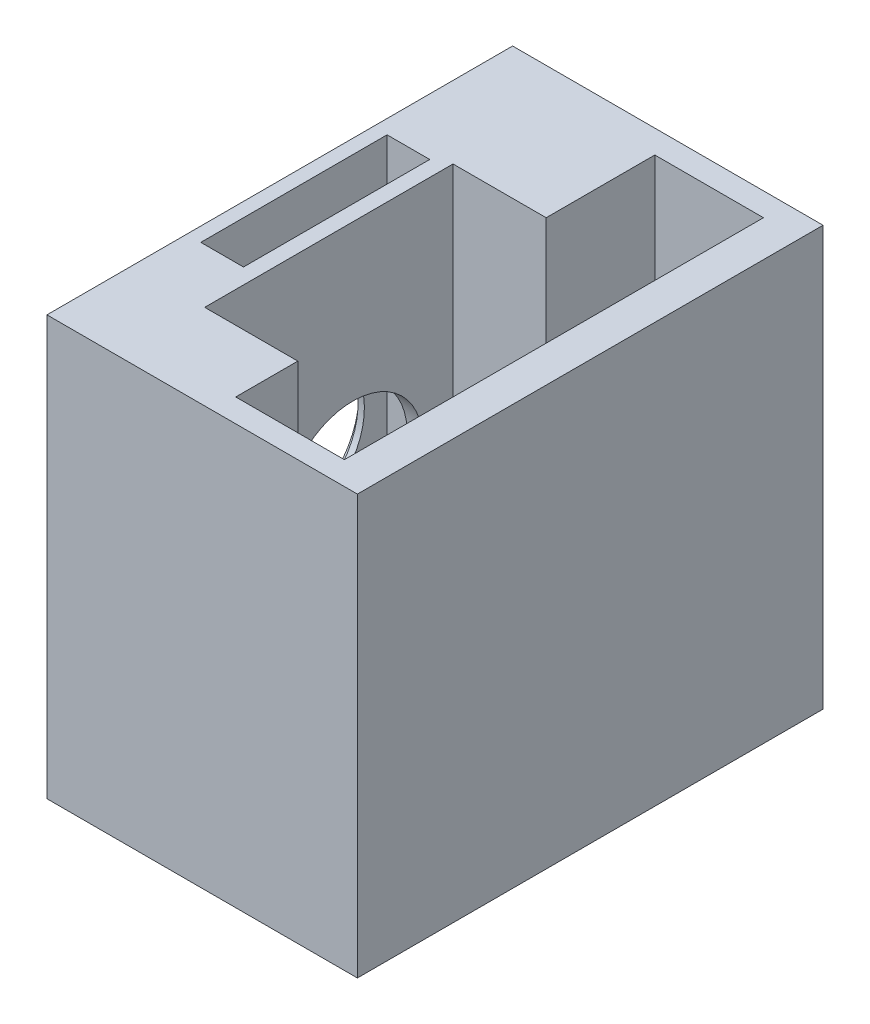
ISO-10303-21;
HEADER;
FILE_DESCRIPTION(('STEP AP214'),'2;1');
FILE_NAME('part.step','',(''),(''),'','','');
FILE_SCHEMA(('AUTOMOTIVE_DESIGN { 1 0 10303 214 1 1 1 1 }'));
ENDSEC;
DATA;
#1=APPLICATION_CONTEXT('core data for automotive mechanical design processes');
#2=APPLICATION_PROTOCOL_DEFINITION('international standard','automotive_design',2000,#1);
#3=PRODUCT_CONTEXT('',#1,'mechanical');
#4=PRODUCT('Part','Part','',(#3));
#5=PRODUCT_RELATED_PRODUCT_CATEGORY('part','',(#4));
#6=PRODUCT_DEFINITION_FORMATION('','',#4);
#7=PRODUCT_DEFINITION_CONTEXT('part definition',#1,'design');
#8=PRODUCT_DEFINITION('design','',#6,#7);
#9=PRODUCT_DEFINITION_SHAPE('','',#8);
#10=(LENGTH_UNIT() NAMED_UNIT(*) SI_UNIT(.MILLI.,.METRE.));
#11=(NAMED_UNIT(*) PLANE_ANGLE_UNIT() SI_UNIT($,.RADIAN.));
#12=(NAMED_UNIT(*) SI_UNIT($,.STERADIAN.) SOLID_ANGLE_UNIT());
#13=UNCERTAINTY_MEASURE_WITH_UNIT(LENGTH_MEASURE(1.E-05),#10,'distance_accuracy_value','');
#14=(GEOMETRIC_REPRESENTATION_CONTEXT(3) GLOBAL_UNCERTAINTY_ASSIGNED_CONTEXT((#13)) GLOBAL_UNIT_ASSIGNED_CONTEXT((#10,
#11,#12)) REPRESENTATION_CONTEXT('',''));
#15=CARTESIAN_POINT('',(0.,0.,0.));
#16=DIRECTION('',(0.,0.,1.));
#17=DIRECTION('',(1.,0.,0.));
#18=AXIS2_PLACEMENT_3D('',#15,#16,#17);
#19=CARTESIAN_POINT('',(0.,9.5,0.));
#20=DIRECTION('',(0.,1.,0.));
#21=DIRECTION('',(0.,0.,1.));
#22=AXIS2_PLACEMENT_3D('',#19,#20,#21);
#23=PLANE('',#22);
#24=DIRECTION('',(-1.,0.,0.));
#25=VECTOR('',#24,1.);
#26=CARTESIAN_POINT('',(5.5,9.5,-18.3941019662497));
#27=LINE('',#26,#25);
#28=CARTESIAN_POINT('',(3.66196126146727,9.5,-18.3941019662497));
#29=VERTEX_POINT('',#28);
#30=CARTESIAN_POINT('',(0.911961261467271,9.5,-18.3941019662497));
#31=VERTEX_POINT('',#30);
#32=EDGE_CURVE('E11',#29,#31,#27,.T.);
#33=ORIENTED_EDGE('',*,*,#32,.F.);
#34=DIRECTION('',(0.,0.,-1.));
#35=VECTOR('',#34,1.);
#36=CARTESIAN_POINT('',(3.66196126146727,9.5,-21.));
#37=LINE('',#36,#35);
#38=CARTESIAN_POINT('',(3.66196126146727,9.5,-21.));
#39=VERTEX_POINT('',#38);
#40=EDGE_CURVE('E172',#29,#39,#37,.T.);
#41=ORIENTED_EDGE('',*,*,#40,.T.);
#42=DIRECTION('',(-1.,0.,0.));
#43=VECTOR('',#42,1.);
#44=CARTESIAN_POINT('',(0.911961261467271,9.5,-21.));
#45=LINE('',#44,#43);
#46=CARTESIAN_POINT('',(0.911961261467271,9.5,-21.));
#47=VERTEX_POINT('',#46);
#48=EDGE_CURVE('E178',#39,#47,#45,.T.);
#49=ORIENTED_EDGE('',*,*,#48,.T.);
#50=DIRECTION('',(0.,0.,1.));
#51=VECTOR('',#50,1.);
#52=CARTESIAN_POINT('',(0.911961261467271,9.5,-21.));
#53=LINE('',#52,#51);
#54=EDGE_CURVE('E588',#47,#31,#53,.T.);
#55=ORIENTED_EDGE('',*,*,#54,.T.);
#56=EDGE_LOOP('',(#33,#41,#49,#55));
#57=FACE_BOUND('',#56,.T.);
#58=ADVANCED_FACE('F34',(#57),#23,.T.);
#59=CARTESIAN_POINT('',(20.,27.,0.));
#60=DIRECTION('',(0.,-1.,0.));
#61=DIRECTION('',(0.,0.,-1.));
#62=AXIS2_PLACEMENT_3D('',#59,#60,#61);
#63=PLANE('',#62);
#64=DIRECTION('',(1.,0.,0.));
#65=VECTOR('',#64,1.);
#66=CARTESIAN_POINT('',(0.911961261467272,27.,-9.));
#67=LINE('',#66,#65);
#68=CARTESIAN_POINT('',(0.911961261467274,27.,-9.));
#69=VERTEX_POINT('',#68);
#70=CARTESIAN_POINT('',(3.66196126146727,27.,-9.));
#71=VERTEX_POINT('',#70);
#72=EDGE_CURVE('E187',#69,#71,#67,.T.);
#73=ORIENTED_EDGE('',*,*,#72,.F.);
#74=DIRECTION('',(0.,0.,1.));
#75=VECTOR('',#74,1.);
#76=CARTESIAN_POINT('',(0.911961261467271,27.,-21.));
#77=LINE('',#76,#75);
#78=CARTESIAN_POINT('',(0.911961261467271,27.,-21.));
#79=VERTEX_POINT('',#78);
#80=EDGE_CURVE('E56',#79,#69,#77,.T.);
#81=ORIENTED_EDGE('',*,*,#80,.F.);
#82=DIRECTION('',(-1.,0.,0.));
#83=VECTOR('',#82,1.);
#84=CARTESIAN_POINT('',(0.911961261467271,27.,-21.));
#85=LINE('',#84,#83);
#86=CARTESIAN_POINT('',(3.66196126146727,27.,-21.));
#87=VERTEX_POINT('',#86);
#88=EDGE_CURVE('E194',#87,#79,#85,.T.);
#89=ORIENTED_EDGE('',*,*,#88,.F.);
#90=DIRECTION('',(0.,0.,-1.));
#91=VECTOR('',#90,1.);
#92=CARTESIAN_POINT('',(3.66196126146727,27.,-21.));
#93=LINE('',#92,#91);
#94=EDGE_CURVE('E191',#71,#87,#93,.T.);
#95=ORIENTED_EDGE('',*,*,#94,.F.);
#96=EDGE_LOOP('',(#73,#81,#89,#95));
#97=FACE_BOUND('',#96,.T.);
#98=DIRECTION('',(0.,0.,1.));
#99=VECTOR('',#98,1.);
#100=CARTESIAN_POINT('',(0.,27.,0.));
#101=LINE('',#100,#99);
#102=CARTESIAN_POINT('',(0.,27.,-30.));
#103=VERTEX_POINT('',#102);
#104=CARTESIAN_POINT('',(0.,27.,0.));
#105=VERTEX_POINT('',#104);
#106=EDGE_CURVE('E278',#103,#105,#101,.T.);
#107=ORIENTED_EDGE('',*,*,#106,.T.);
#108=DIRECTION('',(-1.,0.,0.));
#109=VECTOR('',#108,1.);
#110=CARTESIAN_POINT('',(20.,27.,0.));
#111=LINE('',#110,#109);
#112=CARTESIAN_POINT('',(20.,27.,0.));
#113=VERTEX_POINT('',#112);
#114=EDGE_CURVE('E284',#113,#105,#111,.T.);
#115=ORIENTED_EDGE('',*,*,#114,.F.);
#116=DIRECTION('',(0.,0.,1.));
#117=VECTOR('',#116,1.);
#118=CARTESIAN_POINT('',(20.,27.,0.));
#119=LINE('',#118,#117);
#120=CARTESIAN_POINT('',(20.,27.,-30.));
#121=VERTEX_POINT('',#120);
#122=EDGE_CURVE('E282',#121,#113,#119,.T.);
#123=ORIENTED_EDGE('',*,*,#122,.F.);
#124=DIRECTION('',(-1.,0.,0.));
#125=VECTOR('',#124,1.);
#126=CARTESIAN_POINT('',(20.,27.,-30.));
#127=LINE('',#126,#125);
#128=EDGE_CURVE('E294',#121,#103,#127,.T.);
#129=ORIENTED_EDGE('',*,*,#128,.T.);
#130=EDGE_LOOP('',(#107,#115,#123,#129));
#131=FACE_BOUND('',#130,.T.);
#132=DIRECTION('',(0.,0.,1.));
#133=VECTOR('',#132,1.);
#134=CARTESIAN_POINT('',(4.66196126146727,27.,-21.5));
#135=LINE('',#134,#133);
#136=CARTESIAN_POINT('',(4.66196126146727,27.,-21.5));
#137=VERTEX_POINT('',#136);
#138=CARTESIAN_POINT('',(4.66196126146727,27.,-5.5));
#139=VERTEX_POINT('',#138);
#140=EDGE_CURVE('E209',#137,#139,#135,.T.);
#141=ORIENTED_EDGE('',*,*,#140,.F.);
#142=DIRECTION('',(-1.,0.,0.));
#143=VECTOR('',#142,1.);
#144=CARTESIAN_POINT('',(4.66196126146727,27.,-21.5));
#145=LINE('',#144,#143);
#146=CARTESIAN_POINT('',(10.6619612614673,27.,-21.5));
#147=VERTEX_POINT('',#146);
#148=EDGE_CURVE('E216',#147,#137,#145,.T.);
#149=ORIENTED_EDGE('',*,*,#148,.F.);
#150=DIRECTION('',(0.,0.,1.));
#151=VECTOR('',#150,1.);
#152=CARTESIAN_POINT('',(10.6619612614673,26.9999999999758,-28.5));
#153=LINE('',#152,#151);
#154=CARTESIAN_POINT('',(10.6619612614673,27.,-28.5));
#155=VERTEX_POINT('',#154);
#156=EDGE_CURVE('E243',#155,#147,#153,.T.);
#157=ORIENTED_EDGE('',*,*,#156,.F.);
#158=DIRECTION('',(1.,0.,0.));
#159=VECTOR('',#158,1.);
#160=CARTESIAN_POINT('',(10.6619612614673,26.9999999999758,-28.5));
#161=LINE('',#160,#159);
#162=CARTESIAN_POINT('',(17.6619612614673,26.9999999999758,-28.5));
#163=VERTEX_POINT('',#162);
#164=EDGE_CURVE('E232',#155,#163,#161,.T.);
#165=ORIENTED_EDGE('',*,*,#164,.T.);
#166=DIRECTION('',(0.,0.,1.));
#167=VECTOR('',#166,1.);
#168=CARTESIAN_POINT('',(17.6619612614673,26.9999999999758,-28.5));
#169=LINE('',#168,#167);
#170=CARTESIAN_POINT('',(17.6619612614673,26.9999999999758,-1.5));
#171=VERTEX_POINT('',#170);
#172=EDGE_CURVE('E254',#163,#171,#169,.T.);
#173=ORIENTED_EDGE('',*,*,#172,.T.);
#174=DIRECTION('',(1.,0.,0.));
#175=VECTOR('',#174,1.);
#176=CARTESIAN_POINT('',(10.6619612614673,26.9999999999758,-1.5));
#177=LINE('',#176,#175);
#178=CARTESIAN_POINT('',(10.6619612614673,26.9999999999758,-1.5));
#179=VERTEX_POINT('',#178);
#180=EDGE_CURVE('E257',#179,#171,#177,.T.);
#181=ORIENTED_EDGE('',*,*,#180,.F.);
#182=CARTESIAN_POINT('',(10.6619612614673,27.,-5.5));
#183=VERTEX_POINT('',#182);
#184=EDGE_CURVE('E260',#183,#179,#153,.T.);
#185=ORIENTED_EDGE('',*,*,#184,.F.);
#186=DIRECTION('',(1.,0.,0.));
#187=VECTOR('',#186,1.);
#188=CARTESIAN_POINT('',(4.66196126146727,27.,-5.5));
#189=LINE('',#188,#187);
#190=EDGE_CURVE('E226',#139,#183,#189,.T.);
#191=ORIENTED_EDGE('',*,*,#190,.F.);
#192=EDGE_LOOP('',(#141,#149,#157,#165,#173,#181,#185,#191));
#193=FACE_BOUND('',#192,.T.);
#194=ADVANCED_FACE('F319',(#97,#131,#193),#63,.F.);
#195=CARTESIAN_POINT('',(20.,0.,0.));
#196=DIRECTION('',(0.,0.,-1.));
#197=DIRECTION('',(0.,1.,0.));
#198=AXIS2_PLACEMENT_3D('',#195,#196,#197);
#199=PLANE('',#198);
#200=DIRECTION('',(0.,-1.,0.));
#201=VECTOR('',#200,1.);
#202=CARTESIAN_POINT('',(0.,0.,0.));
#203=LINE('',#202,#201);
#204=CARTESIAN_POINT('',(0.,0.,0.));
#205=VERTEX_POINT('',#204);
#206=EDGE_CURVE('E273',#105,#205,#203,.T.);
#207=ORIENTED_EDGE('',*,*,#206,.T.);
#208=DIRECTION('',(-1.,0.,0.));
#209=VECTOR('',#208,1.);
#210=CARTESIAN_POINT('',(20.,0.,0.));
#211=LINE('',#210,#209);
#212=CARTESIAN_POINT('',(20.,0.,0.));
#213=VERTEX_POINT('',#212);
#214=EDGE_CURVE('E164',#213,#205,#211,.T.);
#215=ORIENTED_EDGE('',*,*,#214,.F.);
#216=DIRECTION('',(0.,-1.,0.));
#217=VECTOR('',#216,1.);
#218=CARTESIAN_POINT('',(20.,0.,0.));
#219=LINE('',#218,#217);
#220=EDGE_CURVE('E274',#113,#213,#219,.T.);
#221=ORIENTED_EDGE('',*,*,#220,.F.);
#222=ORIENTED_EDGE('',*,*,#114,.T.);
#223=EDGE_LOOP('',(#207,#215,#221,#222));
#224=FACE_BOUND('',#223,.T.);
#225=ADVANCED_FACE('F36',(#224),#199,.F.);
#226=CARTESIAN_POINT('',(20.,0.,0.));
#227=DIRECTION('',(0.,1.,0.));
#228=DIRECTION('',(0.,0.,1.));
#229=AXIS2_PLACEMENT_3D('',#226,#227,#228);
#230=PLANE('',#229);
#231=DIRECTION('',(0.,0.,-1.));
#232=VECTOR('',#231,1.);
#233=CARTESIAN_POINT('',(0.,0.,0.));
#234=LINE('',#233,#232);
#235=CARTESIAN_POINT('',(0.,0.,-30.));
#236=VERTEX_POINT('',#235);
#237=EDGE_CURVE('E287',#205,#236,#234,.T.);
#238=ORIENTED_EDGE('',*,*,#237,.T.);
#239=DIRECTION('',(-1.,0.,0.));
#240=VECTOR('',#239,1.);
#241=CARTESIAN_POINT('',(20.,0.,-30.));
#242=LINE('',#241,#240);
#243=CARTESIAN_POINT('',(20.,0.,-30.));
#244=VERTEX_POINT('',#243);
#245=EDGE_CURVE('E297',#244,#236,#242,.T.);
#246=ORIENTED_EDGE('',*,*,#245,.F.);
#247=DIRECTION('',(0.,0.,-1.));
#248=VECTOR('',#247,1.);
#249=CARTESIAN_POINT('',(20.,0.,0.));
#250=LINE('',#249,#248);
#251=EDGE_CURVE('E277',#213,#244,#250,.T.);
#252=ORIENTED_EDGE('',*,*,#251,.F.);
#253=ORIENTED_EDGE('',*,*,#214,.T.);
#254=EDGE_LOOP('',(#238,#246,#252,#253));
#255=FACE_BOUND('',#254,.T.);
#256=ADVANCED_FACE('F303',(#255),#230,.F.);
#257=CARTESIAN_POINT('',(20.,0.,-30.));
#258=DIRECTION('',(0.,0.,1.));
#259=DIRECTION('',(1.,0.,0.));
#260=AXIS2_PLACEMENT_3D('',#257,#258,#259);
#261=PLANE('',#260);
#262=DIRECTION('',(0.,1.,0.));
#263=VECTOR('',#262,1.);
#264=CARTESIAN_POINT('',(0.,0.,-30.));
#265=LINE('',#264,#263);
#266=EDGE_CURVE('E289',#236,#103,#265,.T.);
#267=ORIENTED_EDGE('',*,*,#266,.T.);
#268=ORIENTED_EDGE('',*,*,#128,.F.);
#269=DIRECTION('',(0.,1.,0.));
#270=VECTOR('',#269,1.);
#271=CARTESIAN_POINT('',(20.,0.,-30.));
#272=LINE('',#271,#270);
#273=EDGE_CURVE('E280',#244,#121,#272,.T.);
#274=ORIENTED_EDGE('',*,*,#273,.F.);
#275=ORIENTED_EDGE('',*,*,#245,.T.);
#276=EDGE_LOOP('',(#267,#268,#274,#275));
#277=FACE_BOUND('',#276,.T.);
#278=ADVANCED_FACE('F315',(#277),#261,.F.);
#279=CARTESIAN_POINT('',(20.,0.,0.));
#280=DIRECTION('',(-1.,0.,0.));
#281=DIRECTION('',(0.,0.,1.));
#282=AXIS2_PLACEMENT_3D('',#279,#280,#281);
#283=PLANE('',#282);
#284=ORIENTED_EDGE('',*,*,#220,.T.);
#285=ORIENTED_EDGE('',*,*,#251,.T.);
#286=ORIENTED_EDGE('',*,*,#273,.T.);
#287=ORIENTED_EDGE('',*,*,#122,.T.);
#288=EDGE_LOOP('',(#284,#285,#286,#287));
#289=FACE_BOUND('',#288,.T.);
#290=ADVANCED_FACE('F322',(#289),#283,.F.);
#291=CARTESIAN_POINT('',(0.,0.,0.));
#292=DIRECTION('',(-1.,0.,0.));
#293=DIRECTION('',(0.,0.,1.));
#294=AXIS2_PLACEMENT_3D('',#291,#292,#293);
#295=PLANE('',#294);
#296=CARTESIAN_POINT('',(0.,12.5,-15.1));
#297=DIRECTION('',(-1.,0.,0.));
#298=DIRECTION('',(0.,0.,1.));
#299=AXIS2_PLACEMENT_3D('',#296,#297,#298);
#300=CIRCLE('',#299,5.);
#301=CARTESIAN_POINT('',(0.,12.5,-10.1));
#302=VERTEX_POINT('',#301);
#303=EDGE_CURVE('E200',#302,#302,#300,.T.);
#304=ORIENTED_EDGE('',*,*,#303,.F.);
#305=EDGE_LOOP('',(#304));
#306=FACE_BOUND('',#305,.T.);
#307=ORIENTED_EDGE('',*,*,#206,.F.);
#308=ORIENTED_EDGE('',*,*,#106,.F.);
#309=ORIENTED_EDGE('',*,*,#266,.F.);
#310=ORIENTED_EDGE('',*,*,#237,.F.);
#311=EDGE_LOOP('',(#307,#308,#309,#310));
#312=FACE_BOUND('',#311,.T.);
#313=ADVANCED_FACE('F311',(#306,#312),#295,.T.);
#314=CARTESIAN_POINT('',(10.6619612614673,0.999999999975808,-28.5));
#315=DIRECTION('',(0.,0.,1.));
#316=DIRECTION('',(1.,0.,0.));
#317=AXIS2_PLACEMENT_3D('',#314,#315,#316);
#318=PLANE('',#317);
#319=ORIENTED_EDGE('',*,*,#164,.F.);
#320=DIRECTION('',(0.,1.,0.));
#321=VECTOR('',#320,1.);
#322=CARTESIAN_POINT('',(10.6619612614673,0.999999999975808,-28.5));
#323=LINE('',#322,#321);
#324=CARTESIAN_POINT('',(10.6619612614673,0.999999999975808,-28.5));
#325=VERTEX_POINT('',#324);
#326=EDGE_CURVE('E251',#325,#155,#323,.T.);
#327=ORIENTED_EDGE('',*,*,#326,.F.);
#328=DIRECTION('',(1.,0.,0.));
#329=VECTOR('',#328,1.);
#330=CARTESIAN_POINT('',(10.6619612614673,0.999999999975808,-28.5));
#331=LINE('',#330,#329);
#332=CARTESIAN_POINT('',(17.6619612614673,0.999999999975808,-28.5));
#333=VERTEX_POINT('',#332);
#334=EDGE_CURVE('E239',#325,#333,#331,.T.);
#335=ORIENTED_EDGE('',*,*,#334,.T.);
#336=DIRECTION('',(0.,1.,0.));
#337=VECTOR('',#336,1.);
#338=CARTESIAN_POINT('',(17.6619612614673,0.999999999975808,-28.5));
#339=LINE('',#338,#337);
#340=EDGE_CURVE('E270',#333,#163,#339,.T.);
#341=ORIENTED_EDGE('',*,*,#340,.T.);
#342=EDGE_LOOP('',(#319,#327,#335,#341));
#343=FACE_BOUND('',#342,.T.);
#344=ADVANCED_FACE('F329',(#343),#318,.T.);
#345=CARTESIAN_POINT('',(17.6619612614673,0.999999999975808,-28.5));
#346=DIRECTION('',(-1.,0.,0.));
#347=DIRECTION('',(0.,0.,1.));
#348=AXIS2_PLACEMENT_3D('',#345,#346,#347);
#349=PLANE('',#348);
#350=ORIENTED_EDGE('',*,*,#172,.F.);
#351=ORIENTED_EDGE('',*,*,#340,.F.);
#352=DIRECTION('',(0.,0.,1.));
#353=VECTOR('',#352,1.);
#354=CARTESIAN_POINT('',(17.6619612614673,0.999999999975808,-28.5));
#355=LINE('',#354,#353);
#356=CARTESIAN_POINT('',(17.6619612614673,0.999999999975808,-1.5));
#357=VERTEX_POINT('',#356);
#358=EDGE_CURVE('E242',#333,#357,#355,.T.);
#359=ORIENTED_EDGE('',*,*,#358,.T.);
#360=DIRECTION('',(0.,1.,0.));
#361=VECTOR('',#360,1.);
#362=CARTESIAN_POINT('',(17.6619612614673,0.999999999975808,-1.5));
#363=LINE('',#362,#361);
#364=EDGE_CURVE('E268',#357,#171,#363,.T.);
#365=ORIENTED_EDGE('',*,*,#364,.T.);
#366=EDGE_LOOP('',(#350,#351,#359,#365));
#367=FACE_BOUND('',#366,.T.);
#368=ADVANCED_FACE('F397',(#367),#349,.T.);
#369=CARTESIAN_POINT('',(10.6619612614673,0.999999999975808,-1.5));
#370=DIRECTION('',(0.,0.,1.));
#371=DIRECTION('',(1.,0.,0.));
#372=AXIS2_PLACEMENT_3D('',#369,#370,#371);
#373=PLANE('',#372);
#374=ORIENTED_EDGE('',*,*,#180,.T.);
#375=ORIENTED_EDGE('',*,*,#364,.F.);
#376=DIRECTION('',(1.,0.,0.));
#377=VECTOR('',#376,1.);
#378=CARTESIAN_POINT('',(10.6619612614673,0.999999999975808,-1.5));
#379=LINE('',#378,#377);
#380=CARTESIAN_POINT('',(10.6619612614673,0.999999999975808,-1.5));
#381=VERTEX_POINT('',#380);
#382=EDGE_CURVE('E245',#381,#357,#379,.T.);
#383=ORIENTED_EDGE('',*,*,#382,.F.);
#384=DIRECTION('',(0.,1.,0.));
#385=VECTOR('',#384,1.);
#386=CARTESIAN_POINT('',(10.6619612614673,0.999999999975808,-1.5));
#387=LINE('',#386,#385);
#388=EDGE_CURVE('E265',#381,#179,#387,.T.);
#389=ORIENTED_EDGE('',*,*,#388,.T.);
#390=EDGE_LOOP('',(#374,#375,#383,#389));
#391=FACE_BOUND('',#390,.T.);
#392=ADVANCED_FACE('F393',(#391),#373,.F.);
#393=CARTESIAN_POINT('',(10.6619612614673,0.999999999975808,-28.5));
#394=DIRECTION('',(-1.,0.,0.));
#395=DIRECTION('',(0.,0.,1.));
#396=AXIS2_PLACEMENT_3D('',#393,#394,#395);
#397=PLANE('',#396);
#398=ORIENTED_EDGE('',*,*,#156,.T.);
#399=DIRECTION('',(0.,1.,0.));
#400=VECTOR('',#399,1.);
#401=CARTESIAN_POINT('',(10.6619612614673,6.,-21.5));
#402=LINE('',#401,#400);
#403=CARTESIAN_POINT('',(10.6619612614673,6.,-21.5));
#404=VERTEX_POINT('',#403);
#405=EDGE_CURVE('E233',#404,#147,#402,.T.);
#406=ORIENTED_EDGE('',*,*,#405,.F.);
#407=DIRECTION('',(0.,0.,-1.));
#408=VECTOR('',#407,1.);
#409=CARTESIAN_POINT('',(10.6619612614673,6.,-21.5));
#410=LINE('',#409,#408);
#411=CARTESIAN_POINT('',(10.6619612614673,6.,-5.5));
#412=VERTEX_POINT('',#411);
#413=EDGE_CURVE('E218',#412,#404,#410,.T.);
#414=ORIENTED_EDGE('',*,*,#413,.F.);
#415=DIRECTION('',(0.,1.,0.));
#416=VECTOR('',#415,1.);
#417=CARTESIAN_POINT('',(10.6619612614673,6.,-5.5));
#418=LINE('',#417,#416);
#419=EDGE_CURVE('E235',#412,#183,#418,.T.);
#420=ORIENTED_EDGE('',*,*,#419,.T.);
#421=ORIENTED_EDGE('',*,*,#184,.T.);
#422=ORIENTED_EDGE('',*,*,#388,.F.);
#423=DIRECTION('',(0.,0.,1.));
#424=VECTOR('',#423,1.);
#425=CARTESIAN_POINT('',(10.6619612614673,0.999999999975808,-28.5));
#426=LINE('',#425,#424);
#427=EDGE_CURVE('E248',#325,#381,#426,.T.);
#428=ORIENTED_EDGE('',*,*,#427,.F.);
#429=ORIENTED_EDGE('',*,*,#326,.T.);
#430=EDGE_LOOP('',(#398,#406,#414,#420,#421,#422,#428,#429));
#431=FACE_BOUND('',#430,.T.);
#432=ADVANCED_FACE('F389',(#431),#397,.F.);
#433=CARTESIAN_POINT('',(0.,0.999999999975808,0.));
#434=DIRECTION('',(0.,-1.,0.));
#435=DIRECTION('',(0.,0.,-1.));
#436=AXIS2_PLACEMENT_3D('',#433,#434,#435);
#437=PLANE('',#436);
#438=ORIENTED_EDGE('',*,*,#334,.F.);
#439=ORIENTED_EDGE('',*,*,#427,.T.);
#440=ORIENTED_EDGE('',*,*,#382,.T.);
#441=ORIENTED_EDGE('',*,*,#358,.F.);
#442=EDGE_LOOP('',(#438,#439,#440,#441));
#443=FACE_BOUND('',#442,.T.);
#444=ADVANCED_FACE('F385',(#443),#437,.F.);
#445=CARTESIAN_POINT('',(4.66196126146727,6.,-21.5));
#446=DIRECTION('',(-1.,0.,0.));
#447=DIRECTION('',(0.,0.,1.));
#448=AXIS2_PLACEMENT_3D('',#445,#446,#447);
#449=PLANE('',#448);
#450=CARTESIAN_POINT('',(4.66196126146727,12.5,-15.04));
#451=DIRECTION('',(-1.,0.,0.));
#452=DIRECTION('',(0.,0.,1.));
#453=AXIS2_PLACEMENT_3D('',#450,#451,#452);
#454=CIRCLE('',#453,4.5);
#455=CARTESIAN_POINT('',(4.66196126146727,12.5,-10.54));
#456=VERTEX_POINT('',#455);
#457=EDGE_CURVE('E188',#456,#456,#454,.T.);
#458=ORIENTED_EDGE('',*,*,#457,.T.);
#459=EDGE_LOOP('',(#458));
#460=FACE_BOUND('',#459,.T.);
#461=ORIENTED_EDGE('',*,*,#140,.T.);
#462=DIRECTION('',(0.,1.,0.));
#463=VECTOR('',#462,1.);
#464=CARTESIAN_POINT('',(4.66196126146727,6.,-5.5));
#465=LINE('',#464,#463);
#466=CARTESIAN_POINT('',(4.66196126146727,6.,-5.5));
#467=VERTEX_POINT('',#466);
#468=EDGE_CURVE('E223',#467,#139,#465,.T.);
#469=ORIENTED_EDGE('',*,*,#468,.F.);
#470=DIRECTION('',(0.,0.,1.));
#471=VECTOR('',#470,1.);
#472=CARTESIAN_POINT('',(4.66196126146727,6.,-21.5));
#473=LINE('',#472,#471);
#474=CARTESIAN_POINT('',(4.66196126146727,6.,-21.5));
#475=VERTEX_POINT('',#474);
#476=EDGE_CURVE('E212',#475,#467,#473,.T.);
#477=ORIENTED_EDGE('',*,*,#476,.F.);
#478=DIRECTION('',(0.,1.,0.));
#479=VECTOR('',#478,1.);
#480=CARTESIAN_POINT('',(4.66196126146727,6.,-21.5));
#481=LINE('',#480,#479);
#482=EDGE_CURVE('E230',#475,#137,#481,.T.);
#483=ORIENTED_EDGE('',*,*,#482,.T.);
#484=EDGE_LOOP('',(#461,#469,#477,#483));
#485=FACE_BOUND('',#484,.T.);
#486=ADVANCED_FACE('F378',(#460,#485),#449,.F.);
#487=CARTESIAN_POINT('',(4.66196126146727,6.,-21.5));
#488=DIRECTION('',(0.,0.,-1.));
#489=DIRECTION('',(-1.,0.,0.));
#490=AXIS2_PLACEMENT_3D('',#487,#488,#489);
#491=PLANE('',#490);
#492=ORIENTED_EDGE('',*,*,#148,.T.);
#493=ORIENTED_EDGE('',*,*,#482,.F.);
#494=DIRECTION('',(-1.,0.,0.));
#495=VECTOR('',#494,1.);
#496=CARTESIAN_POINT('',(4.66196126146727,6.,-21.5));
#497=LINE('',#496,#495);
#498=EDGE_CURVE('E220',#404,#475,#497,.T.);
#499=ORIENTED_EDGE('',*,*,#498,.F.);
#500=ORIENTED_EDGE('',*,*,#405,.T.);
#501=EDGE_LOOP('',(#492,#493,#499,#500));
#502=FACE_BOUND('',#501,.T.);
#503=ADVANCED_FACE('F375',(#502),#491,.F.);
#504=CARTESIAN_POINT('',(4.66196126146727,6.,-5.5));
#505=DIRECTION('',(0.,0.,1.));
#506=DIRECTION('',(1.,0.,0.));
#507=AXIS2_PLACEMENT_3D('',#504,#505,#506);
#508=PLANE('',#507);
#509=ORIENTED_EDGE('',*,*,#190,.T.);
#510=ORIENTED_EDGE('',*,*,#419,.F.);
#511=DIRECTION('',(1.,0.,0.));
#512=VECTOR('',#511,1.);
#513=CARTESIAN_POINT('',(4.66196126146727,6.,-5.5));
#514=LINE('',#513,#512);
#515=EDGE_CURVE('E215',#467,#412,#514,.T.);
#516=ORIENTED_EDGE('',*,*,#515,.F.);
#517=ORIENTED_EDGE('',*,*,#468,.T.);
#518=EDGE_LOOP('',(#509,#510,#516,#517));
#519=FACE_BOUND('',#518,.T.);
#520=ADVANCED_FACE('F373',(#519),#508,.F.);
#521=CARTESIAN_POINT('',(0.,6.,0.));
#522=DIRECTION('',(0.,1.,0.));
#523=DIRECTION('',(0.,0.,1.));
#524=AXIS2_PLACEMENT_3D('',#521,#522,#523);
#525=PLANE('',#524);
#526=ORIENTED_EDGE('',*,*,#476,.T.);
#527=ORIENTED_EDGE('',*,*,#515,.T.);
#528=ORIENTED_EDGE('',*,*,#413,.T.);
#529=ORIENTED_EDGE('',*,*,#498,.T.);
#530=EDGE_LOOP('',(#526,#527,#528,#529));
#531=FACE_BOUND('',#530,.T.);
#532=ADVANCED_FACE('F369',(#531),#525,.T.);
#533=CARTESIAN_POINT('',(0.5,12.5,-15.1));
#534=DIRECTION('',(-1.,0.,0.));
#535=DIRECTION('',(0.,0.,1.));
#536=AXIS2_PLACEMENT_3D('',#533,#534,#535);
#537=CYLINDRICAL_SURFACE('',#536,5.);
#538=CARTESIAN_POINT('',(0.5,12.5,-15.1));
#539=DIRECTION('',(-1.,0.,0.));
#540=DIRECTION('',(0.,0.,1.));
#541=AXIS2_PLACEMENT_3D('',#538,#539,#540);
#542=CIRCLE('',#541,5.);
#543=CARTESIAN_POINT('',(0.5,12.5,-10.1));
#544=VERTEX_POINT('',#543);
#545=EDGE_CURVE('E206',#544,#544,#542,.T.);
#546=ORIENTED_EDGE('',*,*,#545,.F.);
#547=EDGE_LOOP('',(#546));
#548=FACE_BOUND('',#547,.T.);
#549=ORIENTED_EDGE('',*,*,#303,.T.);
#550=EDGE_LOOP('',(#549));
#551=FACE_BOUND('',#550,.T.);
#552=ADVANCED_FACE('F365',(#548,#551),#537,.F.);
#553=CARTESIAN_POINT('',(0.5,12.5,-15.1));
#554=DIRECTION('',(-1.,0.,0.));
#555=DIRECTION('',(0.,0.,1.));
#556=AXIS2_PLACEMENT_3D('',#553,#554,#555);
#557=PLANE('',#556);
#558=CARTESIAN_POINT('',(0.5,12.5,-15.04));
#559=DIRECTION('',(-1.,0.,0.));
#560=DIRECTION('',(0.,0.,1.));
#561=AXIS2_PLACEMENT_3D('',#558,#559,#560);
#562=CIRCLE('',#561,4.5);
#563=CARTESIAN_POINT('',(0.5,12.5,-10.54));
#564=VERTEX_POINT('',#563);
#565=EDGE_CURVE('E173',#564,#564,#562,.T.);
#566=ORIENTED_EDGE('',*,*,#565,.F.);
#567=EDGE_LOOP('',(#566));
#568=FACE_BOUND('',#567,.T.);
#569=ORIENTED_EDGE('',*,*,#545,.T.);
#570=EDGE_LOOP('',(#569));
#571=FACE_BOUND('',#570,.T.);
#572=ADVANCED_FACE('F362',(#568,#571),#557,.T.);
#573=CARTESIAN_POINT('',(0.911961261467271,9.5,-21.));
#574=DIRECTION('',(-1.,0.,0.));
#575=DIRECTION('',(0.,0.,1.));
#576=AXIS2_PLACEMENT_3D('',#573,#574,#575);
#577=PLANE('',#576);
#578=CARTESIAN_POINT('',(0.911961261467272,9.5,-11.6858980337503));
#579=VERTEX_POINT('',#578);
#580=CARTESIAN_POINT('',(0.911961261467272,9.5,-9.));
#581=VERTEX_POINT('',#580);
#582=EDGE_CURVE('E197',#579,#581,#53,.T.);
#583=ORIENTED_EDGE('',*,*,#582,.F.);
#584=CARTESIAN_POINT('',(0.911961261467272,12.5,-15.04));
#585=DIRECTION('',(-1.,0.,0.));
#586=DIRECTION('',(0.,0.,1.));
#587=AXIS2_PLACEMENT_3D('',#584,#585,#586);
#588=CIRCLE('',#587,4.5);
#589=EDGE_CURVE('E48',#579,#31,#588,.T.);
#590=ORIENTED_EDGE('',*,*,#589,.T.);
#591=ORIENTED_EDGE('',*,*,#54,.F.);
#592=DIRECTION('',(0.,1.,0.));
#593=VECTOR('',#592,1.);
#594=CARTESIAN_POINT('',(0.911961261467271,9.5,-21.));
#595=LINE('',#594,#593);
#596=EDGE_CURVE('E198',#47,#79,#595,.T.);
#597=ORIENTED_EDGE('',*,*,#596,.T.);
#598=ORIENTED_EDGE('',*,*,#80,.T.);
#599=DIRECTION('',(0.,1.,0.));
#600=VECTOR('',#599,1.);
#601=CARTESIAN_POINT('',(0.911961261467272,9.5,-9.));
#602=LINE('',#601,#600);
#603=EDGE_CURVE('E181',#581,#69,#602,.T.);
#604=ORIENTED_EDGE('',*,*,#603,.F.);
#605=EDGE_LOOP('',(#583,#590,#591,#597,#598,#604));
#606=FACE_BOUND('',#605,.T.);
#607=ADVANCED_FACE('F359',(#606),#577,.F.);
#608=CARTESIAN_POINT('',(0.911961261467271,9.5,-21.));
#609=DIRECTION('',(0.,0.,-1.));
#610=DIRECTION('',(-1.,0.,0.));
#611=AXIS2_PLACEMENT_3D('',#608,#609,#610);
#612=PLANE('',#611);
#613=ORIENTED_EDGE('',*,*,#88,.T.);
#614=ORIENTED_EDGE('',*,*,#596,.F.);
#615=ORIENTED_EDGE('',*,*,#48,.F.);
#616=DIRECTION('',(0.,1.,0.));
#617=VECTOR('',#616,1.);
#618=CARTESIAN_POINT('',(3.66196126146727,9.5,-21.));
#619=LINE('',#618,#617);
#620=EDGE_CURVE('E201',#39,#87,#619,.T.);
#621=ORIENTED_EDGE('',*,*,#620,.T.);
#622=EDGE_LOOP('',(#613,#614,#615,#621));
#623=FACE_BOUND('',#622,.T.);
#624=ADVANCED_FACE('F356',(#623),#612,.F.);
#625=CARTESIAN_POINT('',(3.66196126146727,9.5,-21.));
#626=DIRECTION('',(1.,0.,0.));
#627=DIRECTION('',(0.,0.,-1.));
#628=AXIS2_PLACEMENT_3D('',#625,#626,#627);
#629=PLANE('',#628);
#630=ORIENTED_EDGE('',*,*,#40,.F.);
#631=CARTESIAN_POINT('',(3.66196126146727,12.5,-15.04));
#632=DIRECTION('',(1.,0.,0.));
#633=DIRECTION('',(0.,0.,-1.));
#634=AXIS2_PLACEMENT_3D('',#631,#632,#633);
#635=CIRCLE('',#634,4.5);
#636=CARTESIAN_POINT('',(3.66196126146727,9.5,-11.6858980337503));
#637=VERTEX_POINT('',#636);
#638=EDGE_CURVE('E159',#29,#637,#635,.T.);
#639=ORIENTED_EDGE('',*,*,#638,.T.);
#640=CARTESIAN_POINT('',(3.66196126146727,9.5,-9.));
#641=VERTEX_POINT('',#640);
#642=EDGE_CURVE('E169',#641,#637,#37,.T.);
#643=ORIENTED_EDGE('',*,*,#642,.F.);
#644=DIRECTION('',(0.,1.,0.));
#645=VECTOR('',#644,1.);
#646=CARTESIAN_POINT('',(3.66196126146727,9.5,-9.));
#647=LINE('',#646,#645);
#648=EDGE_CURVE('E203',#641,#71,#647,.T.);
#649=ORIENTED_EDGE('',*,*,#648,.T.);
#650=ORIENTED_EDGE('',*,*,#94,.T.);
#651=ORIENTED_EDGE('',*,*,#620,.F.);
#652=EDGE_LOOP('',(#630,#639,#643,#649,#650,#651));
#653=FACE_BOUND('',#652,.T.);
#654=ADVANCED_FACE('F168',(#653),#629,.F.);
#655=CARTESIAN_POINT('',(0.911961261467272,9.5,-9.));
#656=DIRECTION('',(0.,0.,1.));
#657=DIRECTION('',(1.,0.,0.));
#658=AXIS2_PLACEMENT_3D('',#655,#656,#657);
#659=PLANE('',#658);
#660=ORIENTED_EDGE('',*,*,#72,.T.);
#661=ORIENTED_EDGE('',*,*,#648,.F.);
#662=DIRECTION('',(1.,0.,0.));
#663=VECTOR('',#662,1.);
#664=CARTESIAN_POINT('',(0.911961261467272,9.5,-9.));
#665=LINE('',#664,#663);
#666=EDGE_CURVE('E177',#581,#641,#665,.T.);
#667=ORIENTED_EDGE('',*,*,#666,.F.);
#668=ORIENTED_EDGE('',*,*,#603,.T.);
#669=EDGE_LOOP('',(#660,#661,#667,#668));
#670=FACE_BOUND('',#669,.T.);
#671=ADVANCED_FACE('F345',(#670),#659,.F.);
#672=DIRECTION('',(-1.,0.,0.));
#673=VECTOR('',#672,1.);
#674=CARTESIAN_POINT('',(5.5,9.5,-11.6858980337503));
#675=LINE('',#674,#673);
#676=EDGE_CURVE('E42',#579,#637,#675,.F.);
#677=ORIENTED_EDGE('',*,*,#676,.F.);
#678=ORIENTED_EDGE('',*,*,#582,.T.);
#679=ORIENTED_EDGE('',*,*,#666,.T.);
#680=ORIENTED_EDGE('',*,*,#642,.T.);
#681=EDGE_LOOP('',(#677,#678,#679,#680));
#682=FACE_BOUND('',#681,.T.);
#683=ADVANCED_FACE('F175',(#682),#23,.T.);
#684=CARTESIAN_POINT('',(5.5,12.5,-15.04));
#685=DIRECTION('',(-1.,0.,0.));
#686=DIRECTION('',(0.,0.,1.));
#687=AXIS2_PLACEMENT_3D('',#684,#685,#686);
#688=CYLINDRICAL_SURFACE('',#687,4.5);
#689=ORIENTED_EDGE('',*,*,#565,.T.);
#690=EDGE_LOOP('',(#689));
#691=FACE_BOUND('',#690,.T.);
#692=ORIENTED_EDGE('',*,*,#32,.T.);
#693=ORIENTED_EDGE('',*,*,#589,.F.);
#694=ORIENTED_EDGE('',*,*,#676,.T.);
#695=ORIENTED_EDGE('',*,*,#638,.F.);
#696=EDGE_LOOP('',(#692,#693,#694,#695));
#697=FACE_BOUND('',#696,.T.);
#698=ORIENTED_EDGE('',*,*,#457,.F.);
#699=EDGE_LOOP('',(#698));
#700=FACE_BOUND('',#699,.T.);
#701=ADVANCED_FACE('F157',(#691,#697,#700),#688,.F.);
#702=CLOSED_SHELL('',(#58,#194,#225,#256,#278,#290,#313,#344,#368,#392,#432,#444,#486,#503,#520,
#532,#552,#572,#607,#624,#654,#671,#683,#701));
#703=MANIFOLD_SOLID_BREP('B2',#702);
#704=ADVANCED_BREP_SHAPE_REPRESENTATION('',(#18,#703),#14);
#705=SHAPE_DEFINITION_REPRESENTATION(#9,#704);
ENDSEC;
END-ISO-10303-21;
